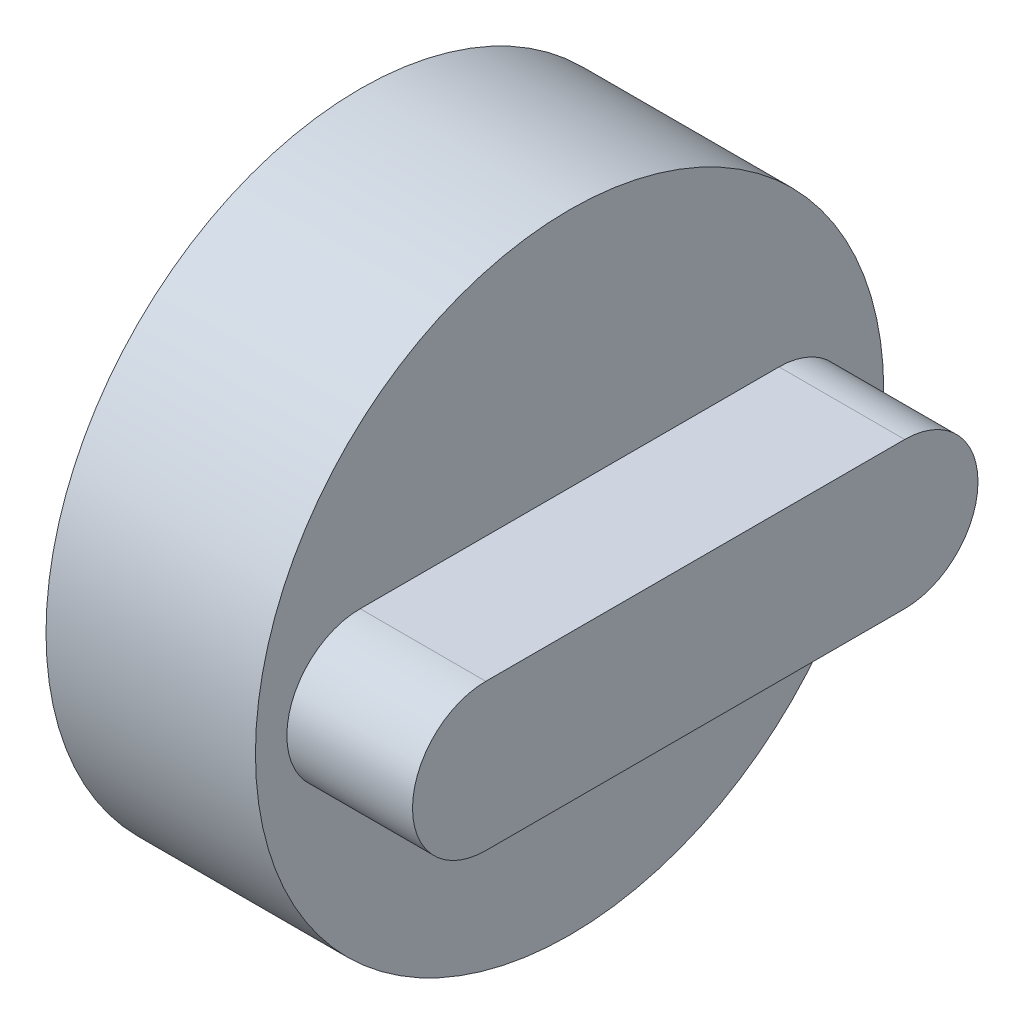
ISO-10303-21;
HEADER;
FILE_DESCRIPTION(('STEP AP214'),'2;1');
FILE_NAME('part.step','',(''),(''),'','','');
FILE_SCHEMA(('AUTOMOTIVE_DESIGN { 1 0 10303 214 1 1 1 1 }'));
ENDSEC;
DATA;
#1=APPLICATION_CONTEXT('core data for automotive mechanical design processes');
#2=APPLICATION_PROTOCOL_DEFINITION('international standard','automotive_design',2000,#1);
#3=PRODUCT_CONTEXT('',#1,'mechanical');
#4=PRODUCT('Part','Part','',(#3));
#5=PRODUCT_RELATED_PRODUCT_CATEGORY('part','',(#4));
#6=PRODUCT_DEFINITION_FORMATION('','',#4);
#7=PRODUCT_DEFINITION_CONTEXT('part definition',#1,'design');
#8=PRODUCT_DEFINITION('design','',#6,#7);
#9=PRODUCT_DEFINITION_SHAPE('','',#8);
#10=(LENGTH_UNIT() NAMED_UNIT(*) SI_UNIT(.MILLI.,.METRE.));
#11=(NAMED_UNIT(*) PLANE_ANGLE_UNIT() SI_UNIT($,.RADIAN.));
#12=(NAMED_UNIT(*) SI_UNIT($,.STERADIAN.) SOLID_ANGLE_UNIT());
#13=UNCERTAINTY_MEASURE_WITH_UNIT(LENGTH_MEASURE(1.E-05),#10,'distance_accuracy_value','');
#14=(GEOMETRIC_REPRESENTATION_CONTEXT(3) GLOBAL_UNCERTAINTY_ASSIGNED_CONTEXT((#13)) GLOBAL_UNIT_ASSIGNED_CONTEXT((#10,
#11,#12)) REPRESENTATION_CONTEXT('',''));
#15=CARTESIAN_POINT('',(0.,0.,0.));
#16=DIRECTION('',(0.,0.,1.));
#17=DIRECTION('',(1.,0.,0.));
#18=AXIS2_PLACEMENT_3D('',#15,#16,#17);
#19=CARTESIAN_POINT('',(0.,0.,0.));
#20=DIRECTION('',(1.,0.,0.));
#21=DIRECTION('',(0.,0.,-1.));
#22=AXIS2_PLACEMENT_3D('',#19,#20,#21);
#23=PLANE('',#22);
#24=CARTESIAN_POINT('',(0.,0.,0.));
#25=DIRECTION('',(1.,0.,0.));
#26=DIRECTION('',(0.,0.,-1.));
#27=AXIS2_PLACEMENT_3D('',#24,#25,#26);
#28=CIRCLE('',#27,15.);
#29=CARTESIAN_POINT('',(0.,0.,-15.));
#30=VERTEX_POINT('',#29);
#31=EDGE_CURVE('E210',#30,#30,#28,.T.);
#32=ORIENTED_EDGE('',*,*,#31,.F.);
#33=EDGE_LOOP('',(#32));
#34=FACE_BOUND('',#33,.T.);
#35=DIRECTION('',(0.,-1.,0.));
#36=VECTOR('',#35,1.);
#37=CARTESIAN_POINT('',(0.,0.,-0.43878415724337));
#38=LINE('',#37,#36);
#39=CARTESIAN_POINT('',(0.,-2.46119248807407,-0.43878415724337));
#40=VERTEX_POINT('',#39);
#41=CARTESIAN_POINT('',(0.,-2.55527244512314,-0.438784157243369));
#42=VERTEX_POINT('',#41);
#43=EDGE_CURVE('E142',#40,#42,#38,.T.);
#44=ORIENTED_EDGE('',*,*,#43,.F.);
#45=CARTESIAN_POINT('',(0.,0.,0.));
#46=DIRECTION('',(-1.,0.,0.));
#47=DIRECTION('',(0.,0.,1.));
#48=AXIS2_PLACEMENT_3D('',#45,#46,#47);
#49=CIRCLE('',#48,2.5);
#50=CARTESIAN_POINT('',(0.,-2.46983910509005,0.387162491685334));
#51=VERTEX_POINT('',#50);
#52=EDGE_CURVE('E160',#51,#40,#49,.T.);
#53=ORIENTED_EDGE('',*,*,#52,.F.);
#54=DIRECTION('',(0.,1.,0.));
#55=VECTOR('',#54,1.);
#56=CARTESIAN_POINT('',(0.,0.,0.387162491685333));
#57=LINE('',#56,#55);
#58=CARTESIAN_POINT('',(0.,-2.55527244512314,0.387162491685334));
#59=VERTEX_POINT('',#58);
#60=EDGE_CURVE('E148',#59,#51,#57,.T.);
#61=ORIENTED_EDGE('',*,*,#60,.F.);
#62=DIRECTION('',(0.,0.,1.));
#63=VECTOR('',#62,1.);
#64=CARTESIAN_POINT('',(0.,-2.55527244512314,0.));
#65=LINE('',#64,#63);
#66=EDGE_CURVE('E11',#42,#59,#65,.T.);
#67=ORIENTED_EDGE('',*,*,#66,.F.);
#68=EDGE_LOOP('',(#44,#53,#61,#67));
#69=FACE_BOUND('',#68,.T.);
#70=ADVANCED_FACE('F39',(#34,#69),#23,.F.);
#71=CARTESIAN_POINT('',(8.,0.,0.));
#72=DIRECTION('',(-1.,0.,0.));
#73=DIRECTION('',(0.,0.,1.));
#74=AXIS2_PLACEMENT_3D('',#71,#72,#73);
#75=CYLINDRICAL_SURFACE('',#74,2.5);
#76=DIRECTION('',(-1.,0.,0.));
#77=VECTOR('',#76,1.);
#78=CARTESIAN_POINT('',(8.,-2.46119248807407,-0.43878415724337));
#79=LINE('',#78,#77);
#80=CARTESIAN_POINT('',(8.,-2.46119248807407,-0.438784157243369));
#81=VERTEX_POINT('',#80);
#82=EDGE_CURVE('E155',#81,#40,#79,.T.);
#83=ORIENTED_EDGE('',*,*,#82,.F.);
#84=CARTESIAN_POINT('',(8.,0.,0.));
#85=DIRECTION('',(-1.,0.,0.));
#86=DIRECTION('',(0.,0.,1.));
#87=AXIS2_PLACEMENT_3D('',#84,#85,#86);
#88=CIRCLE('',#87,2.5);
#89=CARTESIAN_POINT('',(8.,-2.46983910509005,0.387162491685334));
#90=VERTEX_POINT('',#89);
#91=EDGE_CURVE('E161',#90,#81,#88,.T.);
#92=ORIENTED_EDGE('',*,*,#91,.F.);
#93=DIRECTION('',(-1.,0.,0.));
#94=VECTOR('',#93,1.);
#95=CARTESIAN_POINT('',(8.,-2.46983910509005,0.387162491685334));
#96=LINE('',#95,#94);
#97=EDGE_CURVE('E144',#51,#90,#96,.F.);
#98=ORIENTED_EDGE('',*,*,#97,.F.);
#99=ORIENTED_EDGE('',*,*,#52,.T.);
#100=EDGE_LOOP('',(#83,#92,#98,#99));
#101=FACE_BOUND('',#100,.T.);
#102=ADVANCED_FACE('F228',(#101),#75,.F.);
#103=CARTESIAN_POINT('',(8.,0.,0.));
#104=DIRECTION('',(-1.,0.,0.));
#105=DIRECTION('',(0.,0.,1.));
#106=AXIS2_PLACEMENT_3D('',#103,#104,#105);
#107=PLANE('',#106);
#108=ORIENTED_EDGE('',*,*,#91,.T.);
#109=DIRECTION('',(0.,-1.,0.));
#110=VECTOR('',#109,1.);
#111=CARTESIAN_POINT('',(8.,2.45202911400712,-0.43878415724337));
#112=LINE('',#111,#110);
#113=CARTESIAN_POINT('',(8.,2.45202911400712,-0.43878415724337));
#114=VERTEX_POINT('',#113);
#115=EDGE_CURVE('E230',#114,#81,#112,.T.);
#116=ORIENTED_EDGE('',*,*,#115,.F.);
#117=DIRECTION('',(0.,0.,-1.));
#118=VECTOR('',#117,1.);
#119=CARTESIAN_POINT('',(8.,2.45202911400712,-0.43878415724337));
#120=LINE('',#119,#118);
#121=CARTESIAN_POINT('',(8.,2.45202911400712,0.387162491685333));
#122=VERTEX_POINT('',#121);
#123=EDGE_CURVE('E138',#122,#114,#120,.T.);
#124=ORIENTED_EDGE('',*,*,#123,.F.);
#125=DIRECTION('',(0.,-1.,0.));
#126=VECTOR('',#125,1.);
#127=CARTESIAN_POINT('',(8.,0.,0.387162491685333));
#128=LINE('',#127,#126);
#129=EDGE_CURVE('E48',#122,#90,#128,.T.);
#130=ORIENTED_EDGE('',*,*,#129,.T.);
#131=EDGE_LOOP('',(#108,#116,#124,#130));
#132=FACE_BOUND('',#131,.T.);
#133=ADVANCED_FACE('F222',(#132),#107,.T.);
#134=CARTESIAN_POINT('',(10.,0.,0.));
#135=DIRECTION('',(-1.,0.,0.));
#136=DIRECTION('',(0.,0.,1.));
#137=AXIS2_PLACEMENT_3D('',#134,#135,#136);
#138=CYLINDRICAL_SURFACE('',#137,15.);
#139=CARTESIAN_POINT('',(10.,0.,0.));
#140=DIRECTION('',(1.,0.,0.));
#141=DIRECTION('',(0.,0.,-1.));
#142=AXIS2_PLACEMENT_3D('',#139,#140,#141);
#143=CIRCLE('',#142,15.);
#144=CARTESIAN_POINT('',(10.,0.,-15.));
#145=VERTEX_POINT('',#144);
#146=EDGE_CURVE('E211',#145,#145,#143,.T.);
#147=ORIENTED_EDGE('',*,*,#146,.F.);
#148=EDGE_LOOP('',(#147));
#149=FACE_BOUND('',#148,.T.);
#150=ORIENTED_EDGE('',*,*,#31,.T.);
#151=EDGE_LOOP('',(#150));
#152=FACE_BOUND('',#151,.T.);
#153=ADVANCED_FACE('F41',(#149,#152),#138,.T.);
#154=CARTESIAN_POINT('',(10.,0.,0.));
#155=DIRECTION('',(1.,0.,0.));
#156=DIRECTION('',(0.,0.,-1.));
#157=AXIS2_PLACEMENT_3D('',#154,#155,#156);
#158=PLANE('',#157);
#159=CARTESIAN_POINT('',(10.,0.,10.));
#160=DIRECTION('',(1.,0.,0.));
#161=DIRECTION('',(0.,0.,-1.));
#162=AXIS2_PLACEMENT_3D('',#159,#160,#161);
#163=CIRCLE('',#162,3.5);
#164=CARTESIAN_POINT('',(10.,3.5,10.));
#165=VERTEX_POINT('',#164);
#166=CARTESIAN_POINT('',(10.,-3.5,10.));
#167=VERTEX_POINT('',#166);
#168=EDGE_CURVE('E63',#165,#167,#163,.T.);
#169=ORIENTED_EDGE('',*,*,#168,.F.);
#170=DIRECTION('',(0.,0.,1.));
#171=VECTOR('',#170,1.);
#172=CARTESIAN_POINT('',(10.,3.5,10.));
#173=LINE('',#172,#171);
#174=CARTESIAN_POINT('',(10.,3.5,-10.));
#175=VERTEX_POINT('',#174);
#176=EDGE_CURVE('E173',#175,#165,#173,.T.);
#177=ORIENTED_EDGE('',*,*,#176,.F.);
#178=CARTESIAN_POINT('',(10.,0.,-10.));
#179=DIRECTION('',(1.,0.,0.));
#180=DIRECTION('',(0.,0.,-1.));
#181=AXIS2_PLACEMENT_3D('',#178,#179,#180);
#182=CIRCLE('',#181,3.5);
#183=CARTESIAN_POINT('',(10.,-3.5,-10.));
#184=VERTEX_POINT('',#183);
#185=EDGE_CURVE('E189',#184,#175,#182,.T.);
#186=ORIENTED_EDGE('',*,*,#185,.F.);
#187=DIRECTION('',(0.,0.,-1.));
#188=VECTOR('',#187,1.);
#189=CARTESIAN_POINT('',(10.,-3.5,10.));
#190=LINE('',#189,#188);
#191=EDGE_CURVE('E185',#167,#184,#190,.T.);
#192=ORIENTED_EDGE('',*,*,#191,.F.);
#193=EDGE_LOOP('',(#169,#177,#186,#192));
#194=FACE_BOUND('',#193,.T.);
#195=ORIENTED_EDGE('',*,*,#146,.T.);
#196=EDGE_LOOP('',(#195));
#197=FACE_BOUND('',#196,.T.);
#198=ADVANCED_FACE('F263',(#194,#197),#158,.T.);
#199=CARTESIAN_POINT('',(16.,0.,10.));
#200=DIRECTION('',(-1.,0.,0.));
#201=DIRECTION('',(0.,0.,1.));
#202=AXIS2_PLACEMENT_3D('',#199,#200,#201);
#203=CYLINDRICAL_SURFACE('',#202,3.5);
#204=ORIENTED_EDGE('',*,*,#168,.T.);
#205=DIRECTION('',(-1.,0.,0.));
#206=VECTOR('',#205,1.);
#207=CARTESIAN_POINT('',(16.,-3.5,10.));
#208=LINE('',#207,#206);
#209=CARTESIAN_POINT('',(16.,-3.5,10.));
#210=VERTEX_POINT('',#209);
#211=EDGE_CURVE('E206',#210,#167,#208,.T.);
#212=ORIENTED_EDGE('',*,*,#211,.F.);
#213=CARTESIAN_POINT('',(16.,0.,10.));
#214=DIRECTION('',(1.,0.,0.));
#215=DIRECTION('',(0.,0.,-1.));
#216=AXIS2_PLACEMENT_3D('',#213,#214,#215);
#217=CIRCLE('',#216,3.5);
#218=CARTESIAN_POINT('',(16.,3.5,10.));
#219=VERTEX_POINT('',#218);
#220=EDGE_CURVE('E168',#219,#210,#217,.T.);
#221=ORIENTED_EDGE('',*,*,#220,.F.);
#222=DIRECTION('',(-1.,0.,0.));
#223=VECTOR('',#222,1.);
#224=CARTESIAN_POINT('',(16.,3.5,10.));
#225=LINE('',#224,#223);
#226=EDGE_CURVE('E182',#219,#165,#225,.T.);
#227=ORIENTED_EDGE('',*,*,#226,.T.);
#228=EDGE_LOOP('',(#204,#212,#221,#227));
#229=FACE_BOUND('',#228,.T.);
#230=ADVANCED_FACE('F266',(#229),#203,.T.);
#231=CARTESIAN_POINT('',(16.,-3.5,10.));
#232=DIRECTION('',(0.,1.,0.));
#233=DIRECTION('',(0.,0.,1.));
#234=AXIS2_PLACEMENT_3D('',#231,#232,#233);
#235=PLANE('',#234);
#236=ORIENTED_EDGE('',*,*,#191,.T.);
#237=DIRECTION('',(-1.,0.,0.));
#238=VECTOR('',#237,1.);
#239=CARTESIAN_POINT('',(16.,-3.5,-10.));
#240=LINE('',#239,#238);
#241=CARTESIAN_POINT('',(16.,-3.5,-10.));
#242=VERTEX_POINT('',#241);
#243=EDGE_CURVE('E202',#242,#184,#240,.T.);
#244=ORIENTED_EDGE('',*,*,#243,.F.);
#245=DIRECTION('',(0.,0.,-1.));
#246=VECTOR('',#245,1.);
#247=CARTESIAN_POINT('',(16.,-3.5,10.));
#248=LINE('',#247,#246);
#249=EDGE_CURVE('E172',#210,#242,#248,.T.);
#250=ORIENTED_EDGE('',*,*,#249,.F.);
#251=ORIENTED_EDGE('',*,*,#211,.T.);
#252=EDGE_LOOP('',(#236,#244,#250,#251));
#253=FACE_BOUND('',#252,.T.);
#254=ADVANCED_FACE('F269',(#253),#235,.F.);
#255=CARTESIAN_POINT('',(16.,0.,-10.));
#256=DIRECTION('',(-1.,0.,0.));
#257=DIRECTION('',(0.,0.,1.));
#258=AXIS2_PLACEMENT_3D('',#255,#256,#257);
#259=CYLINDRICAL_SURFACE('',#258,3.5);
#260=ORIENTED_EDGE('',*,*,#185,.T.);
#261=DIRECTION('',(-1.,0.,0.));
#262=VECTOR('',#261,1.);
#263=CARTESIAN_POINT('',(16.,3.5,-10.));
#264=LINE('',#263,#262);
#265=CARTESIAN_POINT('',(16.,3.5,-10.));
#266=VERTEX_POINT('',#265);
#267=EDGE_CURVE('E198',#266,#175,#264,.T.);
#268=ORIENTED_EDGE('',*,*,#267,.F.);
#269=CARTESIAN_POINT('',(16.,0.,-10.));
#270=DIRECTION('',(1.,0.,0.));
#271=DIRECTION('',(0.,0.,-1.));
#272=AXIS2_PLACEMENT_3D('',#269,#270,#271);
#273=CIRCLE('',#272,3.5);
#274=EDGE_CURVE('E176',#242,#266,#273,.T.);
#275=ORIENTED_EDGE('',*,*,#274,.F.);
#276=ORIENTED_EDGE('',*,*,#243,.T.);
#277=EDGE_LOOP('',(#260,#268,#275,#276));
#278=FACE_BOUND('',#277,.T.);
#279=ADVANCED_FACE('F273',(#278),#259,.T.);
#280=CARTESIAN_POINT('',(16.,3.5,10.));
#281=DIRECTION('',(0.,-1.,0.));
#282=DIRECTION('',(0.,0.,-1.));
#283=AXIS2_PLACEMENT_3D('',#280,#281,#282);
#284=PLANE('',#283);
#285=ORIENTED_EDGE('',*,*,#176,.T.);
#286=ORIENTED_EDGE('',*,*,#226,.F.);
#287=DIRECTION('',(0.,0.,1.));
#288=VECTOR('',#287,1.);
#289=CARTESIAN_POINT('',(16.,3.5,10.));
#290=LINE('',#289,#288);
#291=EDGE_CURVE('E179',#266,#219,#290,.T.);
#292=ORIENTED_EDGE('',*,*,#291,.F.);
#293=ORIENTED_EDGE('',*,*,#267,.T.);
#294=EDGE_LOOP('',(#285,#286,#292,#293));
#295=FACE_BOUND('',#294,.T.);
#296=ADVANCED_FACE('F277',(#295),#284,.F.);
#297=CARTESIAN_POINT('',(16.,0.,10.));
#298=DIRECTION('',(1.,0.,0.));
#299=DIRECTION('',(0.,0.,-1.));
#300=AXIS2_PLACEMENT_3D('',#297,#298,#299);
#301=PLANE('',#300);
#302=ORIENTED_EDGE('',*,*,#220,.T.);
#303=ORIENTED_EDGE('',*,*,#249,.T.);
#304=ORIENTED_EDGE('',*,*,#274,.T.);
#305=ORIENTED_EDGE('',*,*,#291,.T.);
#306=EDGE_LOOP('',(#302,#303,#304,#305));
#307=FACE_BOUND('',#306,.T.);
#308=ADVANCED_FACE('F281',(#307),#301,.T.);
#309=CARTESIAN_POINT('',(-7.,-2.55527244512314,-0.438784157243369));
#310=DIRECTION('',(0.,1.,0.));
#311=DIRECTION('',(0.,0.,1.));
#312=AXIS2_PLACEMENT_3D('',#309,#310,#311);
#313=PLANE('',#312);
#314=DIRECTION('',(1.,0.,0.));
#315=VECTOR('',#314,1.);
#316=CARTESIAN_POINT('',(-7.,-2.55527244512314,-0.438784157243369));
#317=LINE('',#316,#315);
#318=CARTESIAN_POINT('',(-7.,-2.55527244512314,-0.438784157243369));
#319=VERTEX_POINT('',#318);
#320=EDGE_CURVE('E121',#319,#42,#317,.T.);
#321=ORIENTED_EDGE('',*,*,#320,.T.);
#322=ORIENTED_EDGE('',*,*,#66,.T.);
#323=DIRECTION('',(1.,0.,0.));
#324=VECTOR('',#323,1.);
#325=CARTESIAN_POINT('',(-7.,-2.55527244512314,0.387162491685334));
#326=LINE('',#325,#324);
#327=CARTESIAN_POINT('',(-7.,-2.55527244512314,0.387162491685334));
#328=VERTEX_POINT('',#327);
#329=EDGE_CURVE('E124',#328,#59,#326,.T.);
#330=ORIENTED_EDGE('',*,*,#329,.F.);
#331=DIRECTION('',(0.,0.,1.));
#332=VECTOR('',#331,1.);
#333=CARTESIAN_POINT('',(-7.,-2.55527244512314,-0.438784157243369));
#334=LINE('',#333,#332);
#335=EDGE_CURVE('E117',#319,#328,#334,.T.);
#336=ORIENTED_EDGE('',*,*,#335,.F.);
#337=EDGE_LOOP('',(#321,#322,#330,#336));
#338=FACE_BOUND('',#337,.T.);
#339=ADVANCED_FACE('F119',(#338),#313,.F.);
#340=CARTESIAN_POINT('',(-7.,2.45202911400712,-0.43878415724337));
#341=DIRECTION('',(0.,0.,1.));
#342=DIRECTION('',(0.,-1.,0.));
#343=AXIS2_PLACEMENT_3D('',#340,#341,#342);
#344=PLANE('',#343);
#345=ORIENTED_EDGE('',*,*,#82,.T.);
#346=ORIENTED_EDGE('',*,*,#43,.T.);
#347=ORIENTED_EDGE('',*,*,#320,.F.);
#348=DIRECTION('',(0.,-1.,0.));
#349=VECTOR('',#348,1.);
#350=CARTESIAN_POINT('',(-7.,2.45202911400712,-0.43878415724337));
#351=LINE('',#350,#349);
#352=CARTESIAN_POINT('',(-7.,2.45202911400712,-0.43878415724337));
#353=VERTEX_POINT('',#352);
#354=EDGE_CURVE('E129',#353,#319,#351,.T.);
#355=ORIENTED_EDGE('',*,*,#354,.F.);
#356=DIRECTION('',(1.,0.,0.));
#357=VECTOR('',#356,1.);
#358=CARTESIAN_POINT('',(-7.,2.45202911400712,-0.43878415724337));
#359=LINE('',#358,#357);
#360=EDGE_CURVE('E237',#353,#114,#359,.T.);
#361=ORIENTED_EDGE('',*,*,#360,.T.);
#362=ORIENTED_EDGE('',*,*,#115,.T.);
#363=EDGE_LOOP('',(#345,#346,#347,#355,#361,#362));
#364=FACE_BOUND('',#363,.T.);
#365=ADVANCED_FACE('F140',(#364),#344,.F.);
#366=CARTESIAN_POINT('',(-7.,2.45202911400712,0.387162491685333));
#367=DIRECTION('',(0.,0.,-1.));
#368=DIRECTION('',(0.,1.,0.));
#369=AXIS2_PLACEMENT_3D('',#366,#367,#368);
#370=PLANE('',#369);
#371=ORIENTED_EDGE('',*,*,#329,.T.);
#372=ORIENTED_EDGE('',*,*,#60,.T.);
#373=ORIENTED_EDGE('',*,*,#97,.T.);
#374=ORIENTED_EDGE('',*,*,#129,.F.);
#375=DIRECTION('',(1.,0.,0.));
#376=VECTOR('',#375,1.);
#377=CARTESIAN_POINT('',(-7.,2.45202911400712,0.387162491685333));
#378=LINE('',#377,#376);
#379=CARTESIAN_POINT('',(-7.,2.45202911400712,0.387162491685333));
#380=VERTEX_POINT('',#379);
#381=EDGE_CURVE('E55',#380,#122,#378,.T.);
#382=ORIENTED_EDGE('',*,*,#381,.F.);
#383=DIRECTION('',(0.,1.,0.));
#384=VECTOR('',#383,1.);
#385=CARTESIAN_POINT('',(-7.,2.45202911400712,0.387162491685333));
#386=LINE('',#385,#384);
#387=EDGE_CURVE('E128',#328,#380,#386,.T.);
#388=ORIENTED_EDGE('',*,*,#387,.F.);
#389=EDGE_LOOP('',(#371,#372,#373,#374,#382,#388));
#390=FACE_BOUND('',#389,.T.);
#391=ADVANCED_FACE('F233',(#390),#370,.F.);
#392=CARTESIAN_POINT('',(-7.,2.45202911400712,-0.43878415724337));
#393=DIRECTION('',(0.,-1.,0.));
#394=DIRECTION('',(0.,0.,-1.));
#395=AXIS2_PLACEMENT_3D('',#392,#393,#394);
#396=PLANE('',#395);
#397=ORIENTED_EDGE('',*,*,#123,.T.);
#398=ORIENTED_EDGE('',*,*,#360,.F.);
#399=DIRECTION('',(0.,0.,-1.));
#400=VECTOR('',#399,1.);
#401=CARTESIAN_POINT('',(-7.,2.45202911400712,-0.43878415724337));
#402=LINE('',#401,#400);
#403=EDGE_CURVE('E133',#380,#353,#402,.T.);
#404=ORIENTED_EDGE('',*,*,#403,.F.);
#405=ORIENTED_EDGE('',*,*,#381,.T.);
#406=EDGE_LOOP('',(#397,#398,#404,#405));
#407=FACE_BOUND('',#406,.T.);
#408=ADVANCED_FACE('F246',(#407),#396,.F.);
#409=CARTESIAN_POINT('',(-7.,0.,0.));
#410=DIRECTION('',(-1.,0.,0.));
#411=DIRECTION('',(0.,0.,1.));
#412=AXIS2_PLACEMENT_3D('',#409,#410,#411);
#413=PLANE('',#412);
#414=ORIENTED_EDGE('',*,*,#354,.T.);
#415=ORIENTED_EDGE('',*,*,#335,.T.);
#416=ORIENTED_EDGE('',*,*,#387,.T.);
#417=ORIENTED_EDGE('',*,*,#403,.T.);
#418=EDGE_LOOP('',(#414,#415,#416,#417));
#419=FACE_BOUND('',#418,.T.);
#420=ADVANCED_FACE('F132',(#419),#413,.T.);
#421=CLOSED_SHELL('',(#70,#102,#133,#153,#198,#230,#254,#279,#296,#308,#339,#365,#391,#408,#420));
#422=MANIFOLD_SOLID_BREP('B2',#421);
#423=ADVANCED_BREP_SHAPE_REPRESENTATION('',(#18,#422),#14);
#424=SHAPE_DEFINITION_REPRESENTATION(#9,#423);
ENDSEC;
END-ISO-10303-21;
